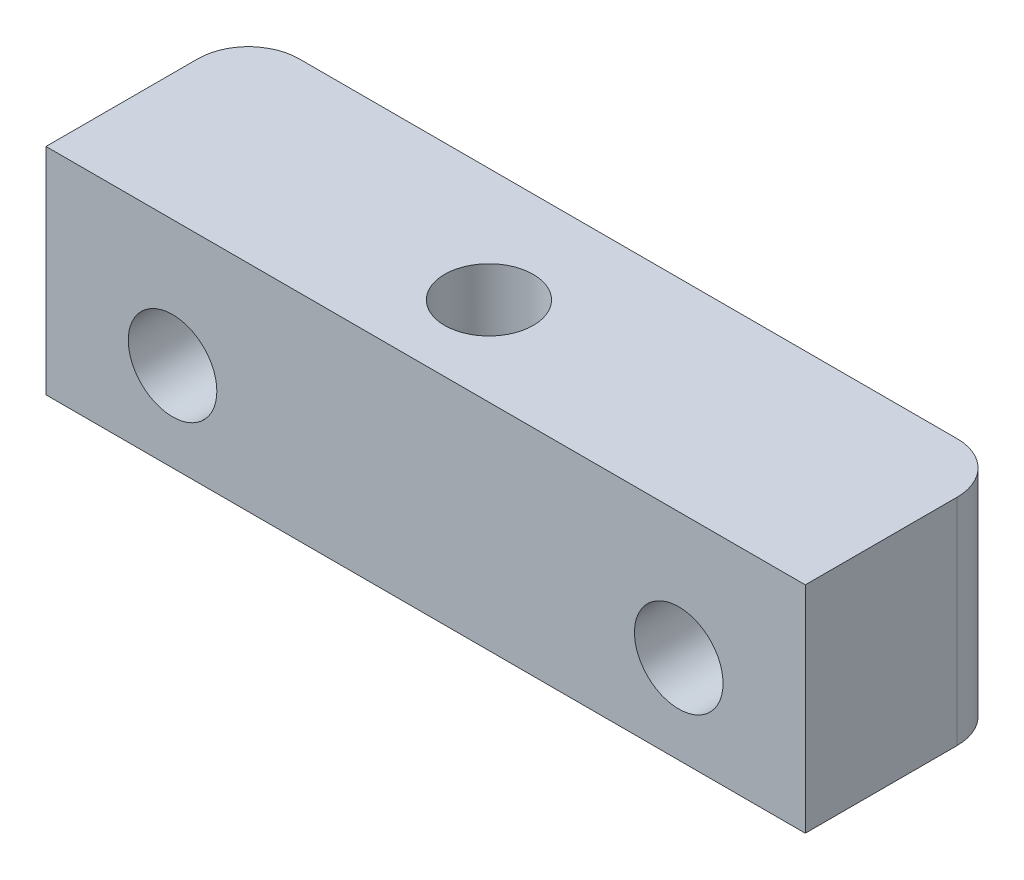
ISO-10303-21;
HEADER;
FILE_DESCRIPTION(('STEP AP214'),'2;1');
FILE_NAME('part.step','',(''),(''),'','','');
FILE_SCHEMA(('AUTOMOTIVE_DESIGN { 1 0 10303 214 1 1 1 1 }'));
ENDSEC;
DATA;
#1=APPLICATION_CONTEXT('core data for automotive mechanical design processes');
#2=APPLICATION_PROTOCOL_DEFINITION('international standard','automotive_design',2000,#1);
#3=PRODUCT_CONTEXT('',#1,'mechanical');
#4=PRODUCT('Part','Part','',(#3));
#5=PRODUCT_RELATED_PRODUCT_CATEGORY('part','',(#4));
#6=PRODUCT_DEFINITION_FORMATION('','',#4);
#7=PRODUCT_DEFINITION_CONTEXT('part definition',#1,'design');
#8=PRODUCT_DEFINITION('design','',#6,#7);
#9=PRODUCT_DEFINITION_SHAPE('','',#8);
#10=(LENGTH_UNIT() NAMED_UNIT(*) SI_UNIT(.MILLI.,.METRE.));
#11=(NAMED_UNIT(*) PLANE_ANGLE_UNIT() SI_UNIT($,.RADIAN.));
#12=(NAMED_UNIT(*) SI_UNIT($,.STERADIAN.) SOLID_ANGLE_UNIT());
#13=UNCERTAINTY_MEASURE_WITH_UNIT(LENGTH_MEASURE(1.E-05),#10,'distance_accuracy_value','');
#14=(GEOMETRIC_REPRESENTATION_CONTEXT(3) GLOBAL_UNCERTAINTY_ASSIGNED_CONTEXT((#13)) GLOBAL_UNIT_ASSIGNED_CONTEXT((#10,
#11,#12)) REPRESENTATION_CONTEXT('',''));
#15=CARTESIAN_POINT('',(0.,0.,0.));
#16=DIRECTION('',(0.,0.,1.));
#17=DIRECTION('',(1.,0.,0.));
#18=AXIS2_PLACEMENT_3D('',#15,#16,#17);
#19=CARTESIAN_POINT('',(-1.,2.,0.5));
#20=DIRECTION('',(0.,-1.,0.));
#21=DIRECTION('',(0.,0.,-1.));
#22=AXIS2_PLACEMENT_3D('',#19,#20,#21);
#23=CYLINDRICAL_SURFACE('',#22,1.75);
#24=CARTESIAN_POINT('',(-1.,2.,0.5));
#25=DIRECTION('',(0.,1.,0.));
#26=DIRECTION('',(0.,0.,1.));
#27=AXIS2_PLACEMENT_3D('',#24,#25,#26);
#28=CIRCLE('',#27,1.75);
#29=CARTESIAN_POINT('',(-1.,2.,2.25));
#30=VERTEX_POINT('',#29);
#31=EDGE_CURVE('E181',#30,#30,#28,.T.);
#32=ORIENTED_EDGE('',*,*,#31,.T.);
#33=EDGE_LOOP('',(#32));
#34=FACE_BOUND('',#33,.T.);
#35=CARTESIAN_POINT('',(-1.,-3.5,0.5));
#36=DIRECTION('',(0.,-1.,0.));
#37=DIRECTION('',(0.,0.,-1.));
#38=AXIS2_PLACEMENT_3D('',#35,#36,#37);
#39=CIRCLE('',#38,1.75);
#40=CARTESIAN_POINT('',(-1.,-3.5,-1.25));
#41=VERTEX_POINT('',#40);
#42=EDGE_CURVE('E38',#41,#41,#39,.T.);
#43=ORIENTED_EDGE('',*,*,#42,.T.);
#44=EDGE_LOOP('',(#43));
#45=FACE_BOUND('',#44,.T.);
#46=ADVANCED_FACE('F34',(#34,#45),#23,.F.);
#47=CARTESIAN_POINT('',(0.,2.,0.));
#48=DIRECTION('',(0.,1.,0.));
#49=DIRECTION('',(0.,0.,1.));
#50=AXIS2_PLACEMENT_3D('',#47,#48,#49);
#51=PLANE('',#50);
#52=DIRECTION('',(-1.,0.,0.));
#53=VECTOR('',#52,1.);
#54=CARTESIAN_POINT('',(-15.,2.,-4.));
#55=LINE('',#54,#53);
#56=CARTESIAN_POINT('',(13.,2.,-4.));
#57=VERTEX_POINT('',#56);
#58=CARTESIAN_POINT('',(-13.,2.,-4.));
#59=VERTEX_POINT('',#58);
#60=EDGE_CURVE('E205',#57,#59,#55,.T.);
#61=ORIENTED_EDGE('',*,*,#60,.T.);
#62=CARTESIAN_POINT('',(-13.,2.,-2.));
#63=DIRECTION('',(0.,1.,0.));
#64=DIRECTION('',(0.,0.,1.));
#65=AXIS2_PLACEMENT_3D('',#62,#63,#64);
#66=CIRCLE('',#65,2.);
#67=CARTESIAN_POINT('',(-15.,2.,-2.));
#68=VERTEX_POINT('',#67);
#69=EDGE_CURVE('E43',#59,#68,#66,.T.);
#70=ORIENTED_EDGE('',*,*,#69,.T.);
#71=DIRECTION('',(0.,0.,1.));
#72=VECTOR('',#71,1.);
#73=CARTESIAN_POINT('',(-15.,2.,-4.));
#74=LINE('',#73,#72);
#75=CARTESIAN_POINT('',(-15.,2.,4.));
#76=VERTEX_POINT('',#75);
#77=EDGE_CURVE('E208',#68,#76,#74,.T.);
#78=ORIENTED_EDGE('',*,*,#77,.T.);
#79=DIRECTION('',(1.,0.,0.));
#80=VECTOR('',#79,1.);
#81=CARTESIAN_POINT('',(-15.,2.,4.));
#82=LINE('',#81,#80);
#83=CARTESIAN_POINT('',(15.,2.,4.));
#84=VERTEX_POINT('',#83);
#85=EDGE_CURVE('E210',#76,#84,#82,.T.);
#86=ORIENTED_EDGE('',*,*,#85,.T.);
#87=DIRECTION('',(0.,0.,-1.));
#88=VECTOR('',#87,1.);
#89=CARTESIAN_POINT('',(15.,2.,-4.));
#90=LINE('',#89,#88);
#91=CARTESIAN_POINT('',(15.,2.,-2.));
#92=VERTEX_POINT('',#91);
#93=EDGE_CURVE('E203',#84,#92,#90,.T.);
#94=ORIENTED_EDGE('',*,*,#93,.T.);
#95=CARTESIAN_POINT('',(13.,2.,-2.));
#96=DIRECTION('',(0.,1.,0.));
#97=DIRECTION('',(0.,0.,1.));
#98=AXIS2_PLACEMENT_3D('',#95,#96,#97);
#99=CIRCLE('',#98,2.);
#100=EDGE_CURVE('E230',#92,#57,#99,.T.);
#101=ORIENTED_EDGE('',*,*,#100,.T.);
#102=EDGE_LOOP('',(#61,#70,#78,#86,#94,#101));
#103=FACE_BOUND('',#102,.T.);
#104=ORIENTED_EDGE('',*,*,#31,.F.);
#105=EDGE_LOOP('',(#104));
#106=FACE_BOUND('',#105,.T.);
#107=ADVANCED_FACE('F235',(#103,#106),#51,.T.);
#108=CARTESIAN_POINT('',(15.,2.,-4.));
#109=DIRECTION('',(-1.,0.,0.));
#110=DIRECTION('',(0.,0.,1.));
#111=AXIS2_PLACEMENT_3D('',#108,#109,#110);
#112=PLANE('',#111);
#113=DIRECTION('',(0.,0.,1.));
#114=VECTOR('',#113,1.);
#115=CARTESIAN_POINT('',(15.,-6.5,-34.6960909563417));
#116=LINE('',#115,#114);
#117=CARTESIAN_POINT('',(15.,-6.5,-2.));
#118=VERTEX_POINT('',#117);
#119=CARTESIAN_POINT('',(15.,-6.5,4.));
#120=VERTEX_POINT('',#119);
#121=EDGE_CURVE('E186',#118,#120,#116,.T.);
#122=ORIENTED_EDGE('',*,*,#121,.F.);
#123=DIRECTION('',(0.,-1.,0.));
#124=VECTOR('',#123,1.);
#125=CARTESIAN_POINT('',(15.,2.,-2.));
#126=LINE('',#125,#124);
#127=EDGE_CURVE('E11',#118,#92,#126,.F.);
#128=ORIENTED_EDGE('',*,*,#127,.T.);
#129=ORIENTED_EDGE('',*,*,#93,.F.);
#130=DIRECTION('',(0.,-1.,0.));
#131=VECTOR('',#130,1.);
#132=CARTESIAN_POINT('',(15.,2.,4.));
#133=LINE('',#132,#131);
#134=EDGE_CURVE('E212',#84,#120,#133,.T.);
#135=ORIENTED_EDGE('',*,*,#134,.T.);
#136=EDGE_LOOP('',(#122,#128,#129,#135));
#137=FACE_BOUND('',#136,.T.);
#138=ADVANCED_FACE('F257',(#137),#112,.F.);
#139=CARTESIAN_POINT('',(-15.,2.,-4.));
#140=DIRECTION('',(0.,0.,1.));
#141=DIRECTION('',(1.,0.,0.));
#142=AXIS2_PLACEMENT_3D('',#139,#140,#141);
#143=PLANE('',#142);
#144=DIRECTION('',(-1.,0.,0.));
#145=VECTOR('',#144,1.);
#146=CARTESIAN_POINT('',(15.,-6.5,-4.));
#147=LINE('',#146,#145);
#148=CARTESIAN_POINT('',(13.,-6.5,-4.));
#149=VERTEX_POINT('',#148);
#150=CARTESIAN_POINT('',(-13.,-6.5,-4.));
#151=VERTEX_POINT('',#150);
#152=EDGE_CURVE('E183',#149,#151,#147,.T.);
#153=ORIENTED_EDGE('',*,*,#152,.T.);
#154=DIRECTION('',(0.,-1.,0.));
#155=VECTOR('',#154,1.);
#156=CARTESIAN_POINT('',(-13.,2.,-4.));
#157=LINE('',#156,#155);
#158=EDGE_CURVE('E228',#151,#59,#157,.F.);
#159=ORIENTED_EDGE('',*,*,#158,.T.);
#160=ORIENTED_EDGE('',*,*,#60,.F.);
#161=DIRECTION('',(0.,-1.,0.));
#162=VECTOR('',#161,1.);
#163=CARTESIAN_POINT('',(13.,2.,-4.));
#164=LINE('',#163,#162);
#165=EDGE_CURVE('E225',#57,#149,#164,.T.);
#166=ORIENTED_EDGE('',*,*,#165,.T.);
#167=EDGE_LOOP('',(#153,#159,#160,#166));
#168=FACE_BOUND('',#167,.T.);
#169=CARTESIAN_POINT('',(10.,-3.,-4.));
#170=DIRECTION('',(0.,0.,1.));
#171=DIRECTION('',(1.,0.,0.));
#172=AXIS2_PLACEMENT_3D('',#169,#170,#171);
#173=CIRCLE('',#172,1.75);
#174=CARTESIAN_POINT('',(11.75,-3.,-4.));
#175=VERTEX_POINT('',#174);
#176=EDGE_CURVE('E182',#175,#175,#173,.F.);
#177=ORIENTED_EDGE('',*,*,#176,.F.);
#178=EDGE_LOOP('',(#177));
#179=FACE_BOUND('',#178,.T.);
#180=CARTESIAN_POINT('',(-10.,-3.,-4.));
#181=DIRECTION('',(0.,0.,1.));
#182=DIRECTION('',(1.,0.,0.));
#183=AXIS2_PLACEMENT_3D('',#180,#181,#182);
#184=CIRCLE('',#183,1.75);
#185=CARTESIAN_POINT('',(-8.25,-3.,-4.));
#186=VERTEX_POINT('',#185);
#187=EDGE_CURVE('E178',#186,#186,#184,.F.);
#188=ORIENTED_EDGE('',*,*,#187,.F.);
#189=EDGE_LOOP('',(#188));
#190=FACE_BOUND('',#189,.T.);
#191=ADVANCED_FACE('F252',(#168,#179,#190),#143,.F.);
#192=CARTESIAN_POINT('',(-15.,2.,-4.));
#193=DIRECTION('',(1.,0.,0.));
#194=DIRECTION('',(0.,0.,-1.));
#195=AXIS2_PLACEMENT_3D('',#192,#193,#194);
#196=PLANE('',#195);
#197=ORIENTED_EDGE('',*,*,#77,.F.);
#198=DIRECTION('',(0.,-1.,0.));
#199=VECTOR('',#198,1.);
#200=CARTESIAN_POINT('',(-15.,2.,-2.));
#201=LINE('',#200,#199);
#202=CARTESIAN_POINT('',(-15.,-6.5,-2.));
#203=VERTEX_POINT('',#202);
#204=EDGE_CURVE('E218',#68,#203,#201,.T.);
#205=ORIENTED_EDGE('',*,*,#204,.T.);
#206=DIRECTION('',(0.,0.,1.));
#207=VECTOR('',#206,1.);
#208=CARTESIAN_POINT('',(-15.,-6.5,-34.6960909563417));
#209=LINE('',#208,#207);
#210=CARTESIAN_POINT('',(-15.,-6.5,4.));
#211=VERTEX_POINT('',#210);
#212=EDGE_CURVE('E196',#203,#211,#209,.T.);
#213=ORIENTED_EDGE('',*,*,#212,.T.);
#214=DIRECTION('',(0.,-1.,0.));
#215=VECTOR('',#214,1.);
#216=CARTESIAN_POINT('',(-15.,2.,4.));
#217=LINE('',#216,#215);
#218=EDGE_CURVE('E215',#76,#211,#217,.T.);
#219=ORIENTED_EDGE('',*,*,#218,.F.);
#220=EDGE_LOOP('',(#197,#205,#213,#219));
#221=FACE_BOUND('',#220,.T.);
#222=ADVANCED_FACE('F243',(#221),#196,.F.);
#223=CARTESIAN_POINT('',(-15.,2.,4.));
#224=DIRECTION('',(0.,0.,-1.));
#225=DIRECTION('',(-1.,0.,0.));
#226=AXIS2_PLACEMENT_3D('',#223,#224,#225);
#227=PLANE('',#226);
#228=ORIENTED_EDGE('',*,*,#218,.T.);
#229=DIRECTION('',(1.,0.,0.));
#230=VECTOR('',#229,1.);
#231=CARTESIAN_POINT('',(15.,-6.5,4.));
#232=LINE('',#231,#230);
#233=EDGE_CURVE('E193',#211,#120,#232,.T.);
#234=ORIENTED_EDGE('',*,*,#233,.T.);
#235=ORIENTED_EDGE('',*,*,#134,.F.);
#236=ORIENTED_EDGE('',*,*,#85,.F.);
#237=EDGE_LOOP('',(#228,#234,#235,#236));
#238=FACE_BOUND('',#237,.T.);
#239=CARTESIAN_POINT('',(10.,-3.,4.));
#240=DIRECTION('',(0.,0.,1.));
#241=DIRECTION('',(1.,0.,0.));
#242=AXIS2_PLACEMENT_3D('',#239,#240,#241);
#243=CIRCLE('',#242,1.75);
#244=CARTESIAN_POINT('',(11.75,-3.,4.));
#245=VERTEX_POINT('',#244);
#246=EDGE_CURVE('E187',#245,#245,#243,.T.);
#247=ORIENTED_EDGE('',*,*,#246,.F.);
#248=EDGE_LOOP('',(#247));
#249=FACE_BOUND('',#248,.T.);
#250=CARTESIAN_POINT('',(-10.,-3.,4.));
#251=DIRECTION('',(0.,0.,1.));
#252=DIRECTION('',(1.,0.,0.));
#253=AXIS2_PLACEMENT_3D('',#250,#251,#252);
#254=CIRCLE('',#253,1.75);
#255=CARTESIAN_POINT('',(-8.25,-3.,4.));
#256=VERTEX_POINT('',#255);
#257=EDGE_CURVE('E190',#256,#256,#254,.T.);
#258=ORIENTED_EDGE('',*,*,#257,.F.);
#259=EDGE_LOOP('',(#258));
#260=FACE_BOUND('',#259,.T.);
#261=ADVANCED_FACE('F260',(#238,#249,#260),#227,.F.);
#262=CARTESIAN_POINT('',(15.,-6.5,-34.6960909563417));
#263=DIRECTION('',(0.,-1.,0.));
#264=DIRECTION('',(0.,0.,-1.));
#265=AXIS2_PLACEMENT_3D('',#262,#263,#264);
#266=PLANE('',#265);
#267=DIRECTION('',(0.5,0.,0.866025403784439));
#268=VECTOR('',#267,1.);
#269=CARTESIAN_POINT('',(0.732050807568881,-6.5,-2.5));
#270=LINE('',#269,#268);
#271=CARTESIAN_POINT('',(0.732050807568881,-6.5,-2.5));
#272=VERTEX_POINT('',#271);
#273=CARTESIAN_POINT('',(2.46410161513776,-6.5,0.5));
#274=VERTEX_POINT('',#273);
#275=EDGE_CURVE('E50',#272,#274,#270,.T.);
#276=ORIENTED_EDGE('',*,*,#275,.F.);
#277=DIRECTION('',(1.,0.,0.));
#278=VECTOR('',#277,1.);
#279=CARTESIAN_POINT('',(-2.73205080756888,-6.5,-2.5));
#280=LINE('',#279,#278);
#281=CARTESIAN_POINT('',(-2.73205080756888,-6.5,-2.5));
#282=VERTEX_POINT('',#281);
#283=EDGE_CURVE('E145',#282,#272,#280,.T.);
#284=ORIENTED_EDGE('',*,*,#283,.F.);
#285=DIRECTION('',(0.5,0.,-0.866025403784439));
#286=VECTOR('',#285,1.);
#287=CARTESIAN_POINT('',(-4.46410161513776,-6.5,0.500000000000001));
#288=LINE('',#287,#286);
#289=CARTESIAN_POINT('',(-4.46410161513776,-6.5,0.500000000000001));
#290=VERTEX_POINT('',#289);
#291=EDGE_CURVE('E148',#290,#282,#288,.T.);
#292=ORIENTED_EDGE('',*,*,#291,.F.);
#293=DIRECTION('',(-0.5,0.,-0.866025403784438));
#294=VECTOR('',#293,1.);
#295=CARTESIAN_POINT('',(-2.73205080756888,-6.5,3.5));
#296=LINE('',#295,#294);
#297=CARTESIAN_POINT('',(-2.73205080756888,-6.5,3.5));
#298=VERTEX_POINT('',#297);
#299=EDGE_CURVE('E164',#298,#290,#296,.T.);
#300=ORIENTED_EDGE('',*,*,#299,.F.);
#301=DIRECTION('',(-1.,0.,0.));
#302=VECTOR('',#301,1.);
#303=CARTESIAN_POINT('',(0.732050807568879,-6.5,3.5));
#304=LINE('',#303,#302);
#305=CARTESIAN_POINT('',(0.732050807568879,-6.5,3.5));
#306=VERTEX_POINT('',#305);
#307=EDGE_CURVE('E161',#306,#298,#304,.T.);
#308=ORIENTED_EDGE('',*,*,#307,.F.);
#309=DIRECTION('',(-0.5,0.,0.866025403784439));
#310=VECTOR('',#309,1.);
#311=CARTESIAN_POINT('',(2.46410161513776,-6.5,0.5));
#312=LINE('',#311,#310);
#313=EDGE_CURVE('E159',#274,#306,#312,.T.);
#314=ORIENTED_EDGE('',*,*,#313,.F.);
#315=EDGE_LOOP('',(#276,#284,#292,#300,#308,#314));
#316=FACE_BOUND('',#315,.T.);
#317=ORIENTED_EDGE('',*,*,#212,.F.);
#318=CARTESIAN_POINT('',(-13.,-6.5,-2.));
#319=DIRECTION('',(0.,-1.,0.));
#320=DIRECTION('',(0.,0.,-1.));
#321=AXIS2_PLACEMENT_3D('',#318,#319,#320);
#322=CIRCLE('',#321,2.);
#323=EDGE_CURVE('E223',#203,#151,#322,.T.);
#324=ORIENTED_EDGE('',*,*,#323,.T.);
#325=ORIENTED_EDGE('',*,*,#152,.F.);
#326=CARTESIAN_POINT('',(13.,-6.5,-2.));
#327=DIRECTION('',(0.,-1.,0.));
#328=DIRECTION('',(0.,0.,-1.));
#329=AXIS2_PLACEMENT_3D('',#326,#327,#328);
#330=CIRCLE('',#329,2.);
#331=EDGE_CURVE('E221',#149,#118,#330,.T.);
#332=ORIENTED_EDGE('',*,*,#331,.T.);
#333=ORIENTED_EDGE('',*,*,#121,.T.);
#334=ORIENTED_EDGE('',*,*,#233,.F.);
#335=EDGE_LOOP('',(#317,#324,#325,#332,#333,#334));
#336=FACE_BOUND('',#335,.T.);
#337=ADVANCED_FACE('F249',(#316,#336),#266,.T.);
#338=CARTESIAN_POINT('',(-10.,-3.,-34.6960909563417));
#339=DIRECTION('',(0.,0.,1.));
#340=DIRECTION('',(1.,0.,0.));
#341=AXIS2_PLACEMENT_3D('',#338,#339,#340);
#342=CYLINDRICAL_SURFACE('',#341,1.75);
#343=ORIENTED_EDGE('',*,*,#187,.T.);
#344=EDGE_LOOP('',(#343));
#345=FACE_BOUND('',#344,.T.);
#346=ORIENTED_EDGE('',*,*,#257,.T.);
#347=EDGE_LOOP('',(#346));
#348=FACE_BOUND('',#347,.T.);
#349=ADVANCED_FACE('F268',(#345,#348),#342,.F.);
#350=CARTESIAN_POINT('',(10.,-3.,-34.6960909563417));
#351=DIRECTION('',(0.,0.,1.));
#352=DIRECTION('',(1.,0.,0.));
#353=AXIS2_PLACEMENT_3D('',#350,#351,#352);
#354=CYLINDRICAL_SURFACE('',#353,1.75);
#355=ORIENTED_EDGE('',*,*,#176,.T.);
#356=EDGE_LOOP('',(#355));
#357=FACE_BOUND('',#356,.T.);
#358=ORIENTED_EDGE('',*,*,#246,.T.);
#359=EDGE_LOOP('',(#358));
#360=FACE_BOUND('',#359,.T.);
#361=ADVANCED_FACE('F270',(#357,#360),#354,.F.);
#362=CARTESIAN_POINT('',(-13.,2.,-2.));
#363=DIRECTION('',(0.,-1.,0.));
#364=DIRECTION('',(0.,0.,-1.));
#365=AXIS2_PLACEMENT_3D('',#362,#363,#364);
#366=CYLINDRICAL_SURFACE('',#365,2.);
#367=ORIENTED_EDGE('',*,*,#69,.F.);
#368=ORIENTED_EDGE('',*,*,#158,.F.);
#369=ORIENTED_EDGE('',*,*,#323,.F.);
#370=ORIENTED_EDGE('',*,*,#204,.F.);
#371=EDGE_LOOP('',(#367,#368,#369,#370));
#372=FACE_BOUND('',#371,.T.);
#373=ADVANCED_FACE('F246',(#372),#366,.T.);
#374=CARTESIAN_POINT('',(13.,2.,-2.));
#375=DIRECTION('',(0.,-1.,0.));
#376=DIRECTION('',(0.,0.,-1.));
#377=AXIS2_PLACEMENT_3D('',#374,#375,#376);
#378=CYLINDRICAL_SURFACE('',#377,2.);
#379=ORIENTED_EDGE('',*,*,#100,.F.);
#380=ORIENTED_EDGE('',*,*,#127,.F.);
#381=ORIENTED_EDGE('',*,*,#331,.F.);
#382=ORIENTED_EDGE('',*,*,#165,.F.);
#383=EDGE_LOOP('',(#379,#380,#381,#382));
#384=FACE_BOUND('',#383,.T.);
#385=ADVANCED_FACE('F36',(#384),#378,.T.);
#386=CARTESIAN_POINT('',(0.732050807568881,-3.5,-2.5));
#387=DIRECTION('',(0.866025403784439,0.,-0.5));
#388=DIRECTION('',(-0.5,0.,-0.866025403784439));
#389=AXIS2_PLACEMENT_3D('',#386,#387,#388);
#390=PLANE('',#389);
#391=ORIENTED_EDGE('',*,*,#275,.T.);
#392=DIRECTION('',(0.,-1.,0.));
#393=VECTOR('',#392,1.);
#394=CARTESIAN_POINT('',(2.46410161513776,-3.5,0.5));
#395=LINE('',#394,#393);
#396=CARTESIAN_POINT('',(2.46410161513776,-3.5,0.5));
#397=VERTEX_POINT('',#396);
#398=EDGE_CURVE('E122',#397,#274,#395,.T.);
#399=ORIENTED_EDGE('',*,*,#398,.F.);
#400=DIRECTION('',(0.5,0.,0.866025403784439));
#401=VECTOR('',#400,1.);
#402=CARTESIAN_POINT('',(0.732050807568881,-3.5,-2.5));
#403=LINE('',#402,#401);
#404=CARTESIAN_POINT('',(0.732050807568881,-3.5,-2.5));
#405=VERTEX_POINT('',#404);
#406=EDGE_CURVE('E126',#405,#397,#403,.T.);
#407=ORIENTED_EDGE('',*,*,#406,.F.);
#408=DIRECTION('',(0.,-1.,0.));
#409=VECTOR('',#408,1.);
#410=CARTESIAN_POINT('',(0.732050807568881,-3.5,-2.5));
#411=LINE('',#410,#409);
#412=EDGE_CURVE('E169',#405,#272,#411,.T.);
#413=ORIENTED_EDGE('',*,*,#412,.T.);
#414=EDGE_LOOP('',(#391,#399,#407,#413));
#415=FACE_BOUND('',#414,.T.);
#416=ADVANCED_FACE('F124',(#415),#390,.F.);
#417=CARTESIAN_POINT('',(-2.73205080756888,-3.5,-2.5));
#418=DIRECTION('',(0.,0.,-1.));
#419=DIRECTION('',(-1.,0.,0.));
#420=AXIS2_PLACEMENT_3D('',#417,#418,#419);
#421=PLANE('',#420);
#422=ORIENTED_EDGE('',*,*,#283,.T.);
#423=ORIENTED_EDGE('',*,*,#412,.F.);
#424=DIRECTION('',(1.,0.,0.));
#425=VECTOR('',#424,1.);
#426=CARTESIAN_POINT('',(-2.73205080756888,-3.5,-2.5));
#427=LINE('',#426,#425);
#428=CARTESIAN_POINT('',(-2.73205080756888,-3.5,-2.5));
#429=VERTEX_POINT('',#428);
#430=EDGE_CURVE('E132',#429,#405,#427,.T.);
#431=ORIENTED_EDGE('',*,*,#430,.F.);
#432=DIRECTION('',(0.,-1.,0.));
#433=VECTOR('',#432,1.);
#434=CARTESIAN_POINT('',(-2.73205080756888,-3.5,-2.5));
#435=LINE('',#434,#433);
#436=EDGE_CURVE('E171',#429,#282,#435,.T.);
#437=ORIENTED_EDGE('',*,*,#436,.T.);
#438=EDGE_LOOP('',(#422,#423,#431,#437));
#439=FACE_BOUND('',#438,.T.);
#440=ADVANCED_FACE('F302',(#439),#421,.F.);
#441=CARTESIAN_POINT('',(-4.46410161513776,-3.5,0.500000000000001));
#442=DIRECTION('',(-0.866025403784439,0.,-0.5));
#443=DIRECTION('',(-0.5,0.,0.866025403784439));
#444=AXIS2_PLACEMENT_3D('',#441,#442,#443);
#445=PLANE('',#444);
#446=ORIENTED_EDGE('',*,*,#291,.T.);
#447=ORIENTED_EDGE('',*,*,#436,.F.);
#448=DIRECTION('',(0.5,0.,-0.866025403784439));
#449=VECTOR('',#448,1.);
#450=CARTESIAN_POINT('',(-4.46410161513776,-3.5,0.500000000000001));
#451=LINE('',#450,#449);
#452=CARTESIAN_POINT('',(-4.46410161513776,-3.5,0.500000000000001));
#453=VERTEX_POINT('',#452);
#454=EDGE_CURVE('E155',#453,#429,#451,.T.);
#455=ORIENTED_EDGE('',*,*,#454,.F.);
#456=DIRECTION('',(0.,-1.,0.));
#457=VECTOR('',#456,1.);
#458=CARTESIAN_POINT('',(-4.46410161513776,-3.5,0.500000000000001));
#459=LINE('',#458,#457);
#460=EDGE_CURVE('E173',#453,#290,#459,.T.);
#461=ORIENTED_EDGE('',*,*,#460,.T.);
#462=EDGE_LOOP('',(#446,#447,#455,#461));
#463=FACE_BOUND('',#462,.T.);
#464=ADVANCED_FACE('F307',(#463),#445,.F.);
#465=CARTESIAN_POINT('',(-2.73205080756888,-3.5,3.5));
#466=DIRECTION('',(-0.866025403784439,0.,0.5));
#467=DIRECTION('',(0.5,0.,0.866025403784439));
#468=AXIS2_PLACEMENT_3D('',#465,#466,#467);
#469=PLANE('',#468);
#470=ORIENTED_EDGE('',*,*,#299,.T.);
#471=ORIENTED_EDGE('',*,*,#460,.F.);
#472=DIRECTION('',(-0.5,0.,-0.866025403784438));
#473=VECTOR('',#472,1.);
#474=CARTESIAN_POINT('',(-2.73205080756888,-3.5,3.5));
#475=LINE('',#474,#473);
#476=CARTESIAN_POINT('',(-2.73205080756888,-3.5,3.5));
#477=VERTEX_POINT('',#476);
#478=EDGE_CURVE('E152',#477,#453,#475,.T.);
#479=ORIENTED_EDGE('',*,*,#478,.F.);
#480=DIRECTION('',(0.,-1.,0.));
#481=VECTOR('',#480,1.);
#482=CARTESIAN_POINT('',(-2.73205080756888,-3.5,3.5));
#483=LINE('',#482,#481);
#484=EDGE_CURVE('E175',#477,#298,#483,.T.);
#485=ORIENTED_EDGE('',*,*,#484,.T.);
#486=EDGE_LOOP('',(#470,#471,#479,#485));
#487=FACE_BOUND('',#486,.T.);
#488=ADVANCED_FACE('F316',(#487),#469,.F.);
#489=CARTESIAN_POINT('',(0.732050807568879,-3.5,3.5));
#490=DIRECTION('',(0.,0.,1.));
#491=DIRECTION('',(1.,0.,0.));
#492=AXIS2_PLACEMENT_3D('',#489,#490,#491);
#493=PLANE('',#492);
#494=ORIENTED_EDGE('',*,*,#307,.T.);
#495=ORIENTED_EDGE('',*,*,#484,.F.);
#496=DIRECTION('',(-1.,0.,0.));
#497=VECTOR('',#496,1.);
#498=CARTESIAN_POINT('',(0.732050807568879,-3.5,3.5));
#499=LINE('',#498,#497);
#500=CARTESIAN_POINT('',(0.732050807568879,-3.5,3.5));
#501=VERTEX_POINT('',#500);
#502=EDGE_CURVE('E140',#501,#477,#499,.T.);
#503=ORIENTED_EDGE('',*,*,#502,.F.);
#504=DIRECTION('',(0.,-1.,0.));
#505=VECTOR('',#504,1.);
#506=CARTESIAN_POINT('',(0.732050807568879,-3.5,3.5));
#507=LINE('',#506,#505);
#508=EDGE_CURVE('E131',#501,#306,#507,.T.);
#509=ORIENTED_EDGE('',*,*,#508,.T.);
#510=EDGE_LOOP('',(#494,#495,#503,#509));
#511=FACE_BOUND('',#510,.T.);
#512=ADVANCED_FACE('F313',(#511),#493,.F.);
#513=CARTESIAN_POINT('',(2.46410161513776,-3.5,0.5));
#514=DIRECTION('',(0.866025403784439,0.,0.5));
#515=DIRECTION('',(0.5,0.,-0.866025403784439));
#516=AXIS2_PLACEMENT_3D('',#513,#514,#515);
#517=PLANE('',#516);
#518=ORIENTED_EDGE('',*,*,#313,.T.);
#519=ORIENTED_EDGE('',*,*,#508,.F.);
#520=DIRECTION('',(-0.5,0.,0.866025403784439));
#521=VECTOR('',#520,1.);
#522=CARTESIAN_POINT('',(2.46410161513776,-3.5,0.5));
#523=LINE('',#522,#521);
#524=EDGE_CURVE('E135',#397,#501,#523,.T.);
#525=ORIENTED_EDGE('',*,*,#524,.F.);
#526=ORIENTED_EDGE('',*,*,#398,.T.);
#527=EDGE_LOOP('',(#518,#519,#525,#526));
#528=FACE_BOUND('',#527,.T.);
#529=ADVANCED_FACE('F136',(#528),#517,.F.);
#530=CARTESIAN_POINT('',(0.,-3.5,0.));
#531=DIRECTION('',(0.,-1.,0.));
#532=DIRECTION('',(0.,0.,-1.));
#533=AXIS2_PLACEMENT_3D('',#530,#531,#532);
#534=PLANE('',#533);
#535=ORIENTED_EDGE('',*,*,#42,.F.);
#536=EDGE_LOOP('',(#535));
#537=FACE_BOUND('',#536,.T.);
#538=ORIENTED_EDGE('',*,*,#406,.T.);
#539=ORIENTED_EDGE('',*,*,#524,.T.);
#540=ORIENTED_EDGE('',*,*,#502,.T.);
#541=ORIENTED_EDGE('',*,*,#478,.T.);
#542=ORIENTED_EDGE('',*,*,#454,.T.);
#543=ORIENTED_EDGE('',*,*,#430,.T.);
#544=EDGE_LOOP('',(#538,#539,#540,#541,#542,#543));
#545=FACE_BOUND('',#544,.T.);
#546=ADVANCED_FACE('F142',(#537,#545),#534,.T.);
#547=CLOSED_SHELL('',(#46,#107,#138,#191,#222,#261,#337,#349,#361,#373,#385,#416,#440,#464,#488,
#512,#529,#546));
#548=MANIFOLD_SOLID_BREP('B2',#547);
#549=ADVANCED_BREP_SHAPE_REPRESENTATION('',(#18,#548),#14);
#550=SHAPE_DEFINITION_REPRESENTATION(#9,#549);
ENDSEC;
END-ISO-10303-21;
